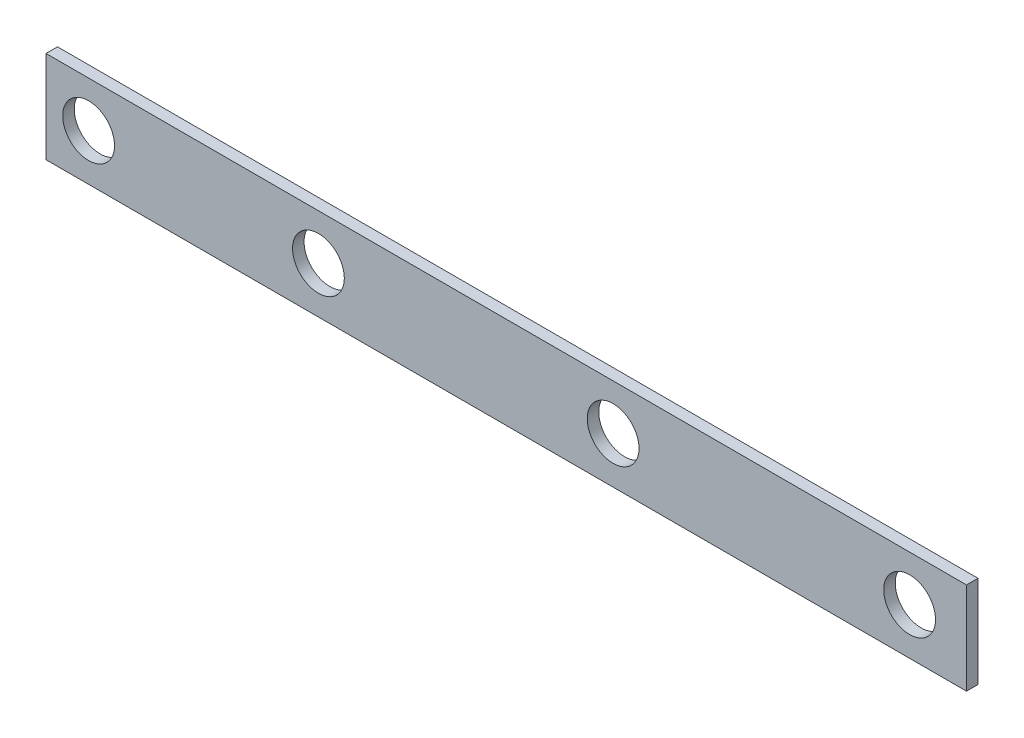
ISO-10303-21;
HEADER;
FILE_DESCRIPTION(('STEP AP214'),'2;1');
FILE_NAME('part.step','',(''),(''),'','','');
FILE_SCHEMA(('AUTOMOTIVE_DESIGN { 1 0 10303 214 1 1 1 1 }'));
ENDSEC;
DATA;
#1=APPLICATION_CONTEXT('core data for automotive mechanical design processes');
#2=APPLICATION_PROTOCOL_DEFINITION('international standard','automotive_design',2000,#1);
#3=PRODUCT_CONTEXT('',#1,'mechanical');
#4=PRODUCT('Part','Part','',(#3));
#5=PRODUCT_RELATED_PRODUCT_CATEGORY('part','',(#4));
#6=PRODUCT_DEFINITION_FORMATION('','',#4);
#7=PRODUCT_DEFINITION_CONTEXT('part definition',#1,'design');
#8=PRODUCT_DEFINITION('design','',#6,#7);
#9=PRODUCT_DEFINITION_SHAPE('','',#8);
#10=(LENGTH_UNIT() NAMED_UNIT(*) SI_UNIT(.MILLI.,.METRE.));
#11=(NAMED_UNIT(*) PLANE_ANGLE_UNIT() SI_UNIT($,.RADIAN.));
#12=(NAMED_UNIT(*) SI_UNIT($,.STERADIAN.) SOLID_ANGLE_UNIT());
#13=UNCERTAINTY_MEASURE_WITH_UNIT(LENGTH_MEASURE(1.E-05),#10,'distance_accuracy_value','');
#14=(GEOMETRIC_REPRESENTATION_CONTEXT(3) GLOBAL_UNCERTAINTY_ASSIGNED_CONTEXT((#13)) GLOBAL_UNIT_ASSIGNED_CONTEXT((#10,
#11,#12)) REPRESENTATION_CONTEXT('',''));
#15=CARTESIAN_POINT('',(0.,0.,0.));
#16=DIRECTION('',(0.,0.,1.));
#17=DIRECTION('',(1.,0.,0.));
#18=AXIS2_PLACEMENT_3D('',#15,#16,#17);
#19=CARTESIAN_POINT('',(-296.652830188679,143.294339622642,6.35));
#20=DIRECTION('',(1.,0.,0.));
#21=DIRECTION('',(0.,0.,-1.));
#22=AXIS2_PLACEMENT_3D('',#19,#20,#21);
#23=PLANE('',#22);
#24=DIRECTION('',(0.,-1.,0.));
#25=VECTOR('',#24,1.);
#26=CARTESIAN_POINT('',(-296.652830188679,143.294339622642,0.));
#27=LINE('',#26,#25);
#28=CARTESIAN_POINT('',(-296.652830188679,143.294339622642,0.));
#29=VERTEX_POINT('',#28);
#30=CARTESIAN_POINT('',(-296.652830188679,92.4943396226415,0.));
#31=VERTEX_POINT('',#30);
#32=EDGE_CURVE('E107',#29,#31,#27,.T.);
#33=ORIENTED_EDGE('',*,*,#32,.T.);
#34=DIRECTION('',(0.,0.,-1.));
#35=VECTOR('',#34,1.);
#36=CARTESIAN_POINT('',(-296.652830188679,92.4943396226415,6.35));
#37=LINE('',#36,#35);
#38=CARTESIAN_POINT('',(-296.652830188679,92.4943396226415,6.35));
#39=VERTEX_POINT('',#38);
#40=EDGE_CURVE('E11',#39,#31,#37,.T.);
#41=ORIENTED_EDGE('',*,*,#40,.F.);
#42=DIRECTION('',(0.,-1.,0.));
#43=VECTOR('',#42,1.);
#44=CARTESIAN_POINT('',(-296.652830188679,143.294339622642,6.35));
#45=LINE('',#44,#43);
#46=CARTESIAN_POINT('',(-296.652830188679,143.294339622642,6.35));
#47=VERTEX_POINT('',#46);
#48=EDGE_CURVE('E91',#47,#39,#45,.T.);
#49=ORIENTED_EDGE('',*,*,#48,.F.);
#50=DIRECTION('',(0.,0.,-1.));
#51=VECTOR('',#50,1.);
#52=CARTESIAN_POINT('',(-296.652830188679,143.294339622642,6.35));
#53=LINE('',#52,#51);
#54=EDGE_CURVE('E103',#47,#29,#53,.T.);
#55=ORIENTED_EDGE('',*,*,#54,.T.);
#56=EDGE_LOOP('',(#33,#41,#49,#55));
#57=FACE_BOUND('',#56,.T.);
#58=ADVANCED_FACE('F39',(#57),#23,.F.);
#59=CARTESIAN_POINT('',(-296.652830188679,92.4943396226415,6.35));
#60=DIRECTION('',(0.,1.,0.));
#61=DIRECTION('',(0.,0.,1.));
#62=AXIS2_PLACEMENT_3D('',#59,#60,#61);
#63=PLANE('',#62);
#64=DIRECTION('',(1.,0.,0.));
#65=VECTOR('',#64,1.);
#66=CARTESIAN_POINT('',(-296.652830188679,92.4943396226415,0.));
#67=LINE('',#66,#65);
#68=CARTESIAN_POINT('',(211.347169811321,92.4943396226415,0.));
#69=VERTEX_POINT('',#68);
#70=EDGE_CURVE('E96',#31,#69,#67,.T.);
#71=ORIENTED_EDGE('',*,*,#70,.T.);
#72=DIRECTION('',(0.,0.,-1.));
#73=VECTOR('',#72,1.);
#74=CARTESIAN_POINT('',(211.347169811321,92.4943396226415,6.35));
#75=LINE('',#74,#73);
#76=CARTESIAN_POINT('',(211.347169811321,92.4943396226415,6.35));
#77=VERTEX_POINT('',#76);
#78=EDGE_CURVE('E48',#77,#69,#75,.T.);
#79=ORIENTED_EDGE('',*,*,#78,.F.);
#80=DIRECTION('',(1.,0.,0.));
#81=VECTOR('',#80,1.);
#82=CARTESIAN_POINT('',(-296.652830188679,92.4943396226415,6.35));
#83=LINE('',#82,#81);
#84=EDGE_CURVE('E86',#39,#77,#83,.T.);
#85=ORIENTED_EDGE('',*,*,#84,.F.);
#86=ORIENTED_EDGE('',*,*,#40,.T.);
#87=EDGE_LOOP('',(#71,#79,#85,#86));
#88=FACE_BOUND('',#87,.T.);
#89=ADVANCED_FACE('F95',(#88),#63,.F.);
#90=CARTESIAN_POINT('',(211.347169811321,143.294339622642,6.35));
#91=DIRECTION('',(-1.,0.,0.));
#92=DIRECTION('',(0.,-1.,0.));
#93=AXIS2_PLACEMENT_3D('',#90,#91,#92);
#94=PLANE('',#93);
#95=DIRECTION('',(0.,1.,0.));
#96=VECTOR('',#95,1.);
#97=CARTESIAN_POINT('',(211.347169811321,143.294339622642,0.));
#98=LINE('',#97,#96);
#99=CARTESIAN_POINT('',(211.347169811321,143.294339622642,0.));
#100=VERTEX_POINT('',#99);
#101=EDGE_CURVE('E73',#69,#100,#98,.T.);
#102=ORIENTED_EDGE('',*,*,#101,.T.);
#103=DIRECTION('',(0.,0.,-1.));
#104=VECTOR('',#103,1.);
#105=CARTESIAN_POINT('',(211.347169811321,143.294339622642,6.35));
#106=LINE('',#105,#104);
#107=CARTESIAN_POINT('',(211.347169811321,143.294339622642,6.35));
#108=VERTEX_POINT('',#107);
#109=EDGE_CURVE('E98',#108,#100,#106,.T.);
#110=ORIENTED_EDGE('',*,*,#109,.F.);
#111=DIRECTION('',(0.,1.,0.));
#112=VECTOR('',#111,1.);
#113=CARTESIAN_POINT('',(211.347169811321,143.294339622642,6.35));
#114=LINE('',#113,#112);
#115=EDGE_CURVE('E89',#77,#108,#114,.T.);
#116=ORIENTED_EDGE('',*,*,#115,.F.);
#117=ORIENTED_EDGE('',*,*,#78,.T.);
#118=EDGE_LOOP('',(#102,#110,#116,#117));
#119=FACE_BOUND('',#118,.T.);
#120=ADVANCED_FACE('F99',(#119),#94,.F.);
#121=CARTESIAN_POINT('',(-296.652830188679,143.294339622642,6.35));
#122=DIRECTION('',(0.,-1.,0.));
#123=DIRECTION('',(0.,0.,-1.));
#124=AXIS2_PLACEMENT_3D('',#121,#122,#123);
#125=PLANE('',#124);
#126=DIRECTION('',(-1.,0.,0.));
#127=VECTOR('',#126,1.);
#128=CARTESIAN_POINT('',(-296.652830188679,143.294339622642,0.));
#129=LINE('',#128,#127);
#130=EDGE_CURVE('E79',#100,#29,#129,.T.);
#131=ORIENTED_EDGE('',*,*,#130,.T.);
#132=ORIENTED_EDGE('',*,*,#54,.F.);
#133=DIRECTION('',(-1.,0.,0.));
#134=VECTOR('',#133,1.);
#135=CARTESIAN_POINT('',(-296.652830188679,143.294339622642,6.35));
#136=LINE('',#135,#134);
#137=EDGE_CURVE('E56',#108,#47,#136,.T.);
#138=ORIENTED_EDGE('',*,*,#137,.F.);
#139=ORIENTED_EDGE('',*,*,#109,.T.);
#140=EDGE_LOOP('',(#131,#132,#138,#139));
#141=FACE_BOUND('',#140,.T.);
#142=ADVANCED_FACE('F121',(#141),#125,.F.);
#143=CARTESIAN_POINT('',(0.,0.,6.35));
#144=DIRECTION('',(0.,0.,1.));
#145=DIRECTION('',(1.,0.,0.));
#146=AXIS2_PLACEMENT_3D('',#143,#144,#145);
#147=PLANE('',#146);
#148=CARTESIAN_POINT('',(-273.13155321049,118.145560077956,6.35));
#149=DIRECTION('',(0.,0.,1.));
#150=DIRECTION('',(1.,0.,0.));
#151=AXIS2_PLACEMENT_3D('',#148,#149,#150);
#152=CIRCLE('',#151,14.2875);
#153=CARTESIAN_POINT('',(-258.84405321049,118.145560077956,6.35));
#154=VERTEX_POINT('',#153);
#155=EDGE_CURVE('E145',#154,#154,#152,.T.);
#156=ORIENTED_EDGE('',*,*,#155,.F.);
#157=EDGE_LOOP('',(#156));
#158=FACE_BOUND('',#157,.T.);
#159=CARTESIAN_POINT('',(16.3306594382959,118.145560077956,6.35));
#160=DIRECTION('',(0.,0.,1.));
#161=DIRECTION('',(1.,0.,0.));
#162=AXIS2_PLACEMENT_3D('',#159,#160,#161);
#163=CIRCLE('',#162,14.2875);
#164=CARTESIAN_POINT('',(30.6181594382959,118.145560077956,6.35));
#165=VERTEX_POINT('',#164);
#166=EDGE_CURVE('E146',#165,#165,#163,.T.);
#167=ORIENTED_EDGE('',*,*,#166,.F.);
#168=EDGE_LOOP('',(#167));
#169=FACE_BOUND('',#168,.T.);
#170=CARTESIAN_POINT('',(-146.306982812391,118.145560077956,6.35));
#171=DIRECTION('',(0.,0.,1.));
#172=DIRECTION('',(1.,0.,0.));
#173=AXIS2_PLACEMENT_3D('',#170,#171,#172);
#174=CIRCLE('',#173,14.2875);
#175=CARTESIAN_POINT('',(-132.019482812391,118.145560077956,6.35));
#176=VERTEX_POINT('',#175);
#177=EDGE_CURVE('E128',#176,#176,#174,.T.);
#178=ORIENTED_EDGE('',*,*,#177,.F.);
#179=EDGE_LOOP('',(#178));
#180=FACE_BOUND('',#179,.T.);
#181=CARTESIAN_POINT('',(179.961208927864,118.145560077956,6.35));
#182=DIRECTION('',(0.,0.,1.));
#183=DIRECTION('',(1.,0.,0.));
#184=AXIS2_PLACEMENT_3D('',#181,#182,#183);
#185=CIRCLE('',#184,14.2875);
#186=CARTESIAN_POINT('',(194.248708927864,118.145560077956,6.35));
#187=VERTEX_POINT('',#186);
#188=EDGE_CURVE('E137',#187,#187,#185,.T.);
#189=ORIENTED_EDGE('',*,*,#188,.F.);
#190=EDGE_LOOP('',(#189));
#191=FACE_BOUND('',#190,.T.);
#192=ORIENTED_EDGE('',*,*,#48,.T.);
#193=ORIENTED_EDGE('',*,*,#84,.T.);
#194=ORIENTED_EDGE('',*,*,#115,.T.);
#195=ORIENTED_EDGE('',*,*,#137,.T.);
#196=EDGE_LOOP('',(#192,#193,#194,#195));
#197=FACE_BOUND('',#196,.T.);
#198=ADVANCED_FACE('F87',(#158,#169,#180,#191,#197),#147,.T.);
#199=CARTESIAN_POINT('',(0.,0.,0.));
#200=DIRECTION('',(0.,0.,1.));
#201=DIRECTION('',(1.,0.,0.));
#202=AXIS2_PLACEMENT_3D('',#199,#200,#201);
#203=PLANE('',#202);
#204=CARTESIAN_POINT('',(-273.13155321049,118.145560077956,0.));
#205=DIRECTION('',(0.,0.,1.));
#206=DIRECTION('',(1.,0.,0.));
#207=AXIS2_PLACEMENT_3D('',#204,#205,#206);
#208=CIRCLE('',#207,14.2875);
#209=CARTESIAN_POINT('',(-258.84405321049,118.145560077956,0.));
#210=VERTEX_POINT('',#209);
#211=EDGE_CURVE('E111',#210,#210,#208,.T.);
#212=ORIENTED_EDGE('',*,*,#211,.T.);
#213=EDGE_LOOP('',(#212));
#214=FACE_BOUND('',#213,.T.);
#215=CARTESIAN_POINT('',(16.3306594382959,118.145560077956,0.));
#216=DIRECTION('',(0.,0.,1.));
#217=DIRECTION('',(1.,0.,0.));
#218=AXIS2_PLACEMENT_3D('',#215,#216,#217);
#219=CIRCLE('',#218,14.2875);
#220=CARTESIAN_POINT('',(30.6181594382959,118.145560077956,0.));
#221=VERTEX_POINT('',#220);
#222=EDGE_CURVE('E133',#221,#221,#219,.T.);
#223=ORIENTED_EDGE('',*,*,#222,.T.);
#224=EDGE_LOOP('',(#223));
#225=FACE_BOUND('',#224,.T.);
#226=CARTESIAN_POINT('',(-146.306982812391,118.145560077956,0.));
#227=DIRECTION('',(0.,0.,1.));
#228=DIRECTION('',(1.,0.,0.));
#229=AXIS2_PLACEMENT_3D('',#226,#227,#228);
#230=CIRCLE('',#229,14.2875);
#231=CARTESIAN_POINT('',(-132.019482812391,118.145560077956,0.));
#232=VERTEX_POINT('',#231);
#233=EDGE_CURVE('E132',#232,#232,#230,.T.);
#234=ORIENTED_EDGE('',*,*,#233,.T.);
#235=EDGE_LOOP('',(#234));
#236=FACE_BOUND('',#235,.T.);
#237=CARTESIAN_POINT('',(179.961208927864,118.145560077956,0.));
#238=DIRECTION('',(0.,0.,1.));
#239=DIRECTION('',(1.,0.,0.));
#240=AXIS2_PLACEMENT_3D('',#237,#238,#239);
#241=CIRCLE('',#240,14.2875);
#242=CARTESIAN_POINT('',(194.248708927864,118.145560077956,0.));
#243=VERTEX_POINT('',#242);
#244=EDGE_CURVE('E141',#243,#243,#241,.T.);
#245=ORIENTED_EDGE('',*,*,#244,.T.);
#246=EDGE_LOOP('',(#245));
#247=FACE_BOUND('',#246,.T.);
#248=ORIENTED_EDGE('',*,*,#32,.F.);
#249=ORIENTED_EDGE('',*,*,#130,.F.);
#250=ORIENTED_EDGE('',*,*,#101,.F.);
#251=ORIENTED_EDGE('',*,*,#70,.F.);
#252=EDGE_LOOP('',(#248,#249,#250,#251));
#253=FACE_BOUND('',#252,.T.);
#254=ADVANCED_FACE('F124',(#214,#225,#236,#247,#253),#203,.F.);
#255=CARTESIAN_POINT('',(179.961208927864,118.145560077956,0.));
#256=DIRECTION('',(0.,0.,1.));
#257=DIRECTION('',(1.,0.,0.));
#258=AXIS2_PLACEMENT_3D('',#255,#256,#257);
#259=CYLINDRICAL_SURFACE('',#258,14.2875);
#260=ORIENTED_EDGE('',*,*,#244,.F.);
#261=EDGE_LOOP('',(#260));
#262=FACE_BOUND('',#261,.T.);
#263=ORIENTED_EDGE('',*,*,#188,.T.);
#264=EDGE_LOOP('',(#263));
#265=FACE_BOUND('',#264,.T.);
#266=ADVANCED_FACE('F178',(#262,#265),#259,.F.);
#267=CARTESIAN_POINT('',(-146.306982812391,118.145560077956,0.));
#268=DIRECTION('',(0.,0.,1.));
#269=DIRECTION('',(1.,0.,0.));
#270=AXIS2_PLACEMENT_3D('',#267,#268,#269);
#271=CYLINDRICAL_SURFACE('',#270,14.2875);
#272=ORIENTED_EDGE('',*,*,#233,.F.);
#273=EDGE_LOOP('',(#272));
#274=FACE_BOUND('',#273,.T.);
#275=ORIENTED_EDGE('',*,*,#177,.T.);
#276=EDGE_LOOP('',(#275));
#277=FACE_BOUND('',#276,.T.);
#278=ADVANCED_FACE('F180',(#274,#277),#271,.F.);
#279=CARTESIAN_POINT('',(16.3306594382959,118.145560077956,0.));
#280=DIRECTION('',(0.,0.,1.));
#281=DIRECTION('',(1.,0.,0.));
#282=AXIS2_PLACEMENT_3D('',#279,#280,#281);
#283=CYLINDRICAL_SURFACE('',#282,14.2875);
#284=ORIENTED_EDGE('',*,*,#222,.F.);
#285=EDGE_LOOP('',(#284));
#286=FACE_BOUND('',#285,.T.);
#287=ORIENTED_EDGE('',*,*,#166,.T.);
#288=EDGE_LOOP('',(#287));
#289=FACE_BOUND('',#288,.T.);
#290=ADVANCED_FACE('F165',(#286,#289),#283,.F.);
#291=CARTESIAN_POINT('',(-273.13155321049,118.145560077956,0.));
#292=DIRECTION('',(0.,0.,1.));
#293=DIRECTION('',(1.,0.,0.));
#294=AXIS2_PLACEMENT_3D('',#291,#292,#293);
#295=CYLINDRICAL_SURFACE('',#294,14.2875);
#296=ORIENTED_EDGE('',*,*,#211,.F.);
#297=EDGE_LOOP('',(#296));
#298=FACE_BOUND('',#297,.T.);
#299=ORIENTED_EDGE('',*,*,#155,.T.);
#300=EDGE_LOOP('',(#299));
#301=FACE_BOUND('',#300,.T.);
#302=ADVANCED_FACE('F162',(#298,#301),#295,.F.);
#303=CLOSED_SHELL('',(#58,#89,#120,#142,#198,#254,#266,#278,#290,#302));
#304=MANIFOLD_SOLID_BREP('B2',#303);
#305=ADVANCED_BREP_SHAPE_REPRESENTATION('',(#18,#304),#14);
#306=SHAPE_DEFINITION_REPRESENTATION(#9,#305);
ENDSEC;
END-ISO-10303-21;
